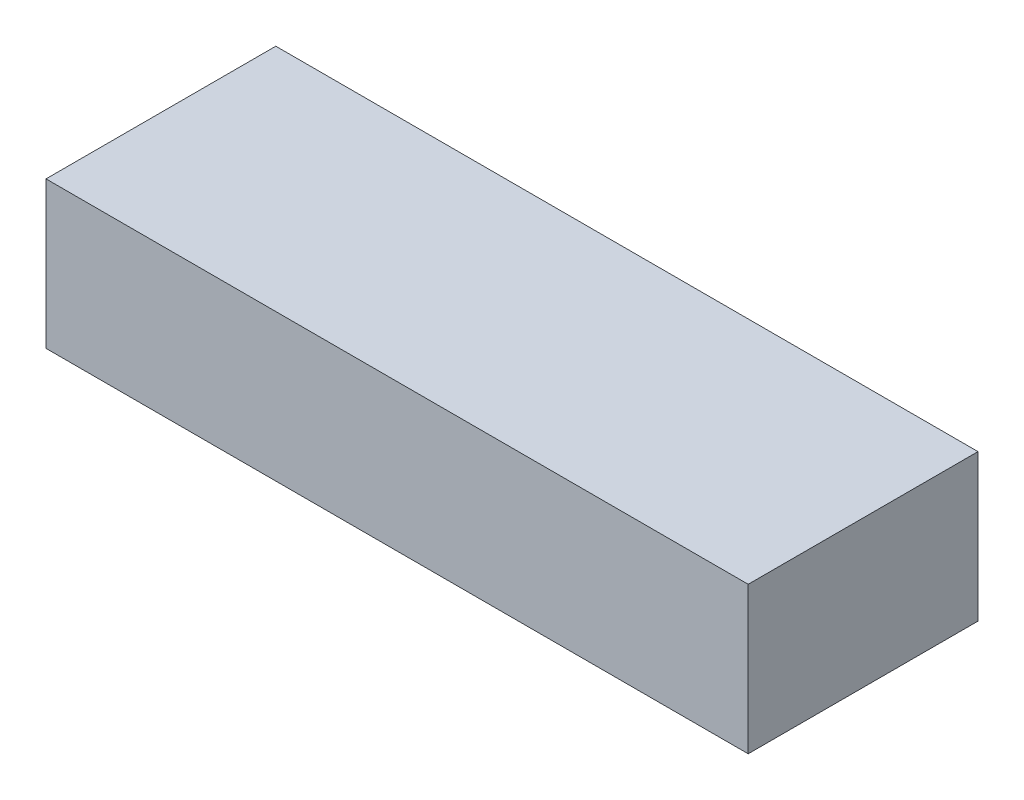
ISO-10303-21;
HEADER;
FILE_DESCRIPTION(('STEP AP214'),'2;1');
FILE_NAME('part.step','',(''),(''),'','','');
FILE_SCHEMA(('AUTOMOTIVE_DESIGN { 1 0 10303 214 1 1 1 1 }'));
ENDSEC;
DATA;
#1=APPLICATION_CONTEXT('core data for automotive mechanical design processes');
#2=APPLICATION_PROTOCOL_DEFINITION('international standard','automotive_design',2000,#1);
#3=PRODUCT_CONTEXT('',#1,'mechanical');
#4=PRODUCT('Part','Part','',(#3));
#5=PRODUCT_RELATED_PRODUCT_CATEGORY('part','',(#4));
#6=PRODUCT_DEFINITION_FORMATION('','',#4);
#7=PRODUCT_DEFINITION_CONTEXT('part definition',#1,'design');
#8=PRODUCT_DEFINITION('design','',#6,#7);
#9=PRODUCT_DEFINITION_SHAPE('','',#8);
#10=(LENGTH_UNIT() NAMED_UNIT(*) SI_UNIT(.MILLI.,.METRE.));
#11=(NAMED_UNIT(*) PLANE_ANGLE_UNIT() SI_UNIT($,.RADIAN.));
#12=(NAMED_UNIT(*) SI_UNIT($,.STERADIAN.) SOLID_ANGLE_UNIT());
#13=UNCERTAINTY_MEASURE_WITH_UNIT(LENGTH_MEASURE(1.E-05),#10,'distance_accuracy_value','');
#14=(GEOMETRIC_REPRESENTATION_CONTEXT(3) GLOBAL_UNCERTAINTY_ASSIGNED_CONTEXT((#13)) GLOBAL_UNIT_ASSIGNED_CONTEXT((#10,
#11,#12)) REPRESENTATION_CONTEXT('',''));
#15=CARTESIAN_POINT('',(0.,0.,0.));
#16=DIRECTION('',(0.,0.,1.));
#17=DIRECTION('',(1.,0.,0.));
#18=AXIS2_PLACEMENT_3D('',#15,#16,#17);
#19=CARTESIAN_POINT('',(55.,23.,-18.));
#20=DIRECTION('',(-1.,0.,0.));
#21=DIRECTION('',(0.,0.,1.));
#22=AXIS2_PLACEMENT_3D('',#19,#20,#21);
#23=PLANE('',#22);
#24=DIRECTION('',(0.,0.,-1.));
#25=VECTOR('',#24,1.);
#26=CARTESIAN_POINT('',(55.,0.,-18.));
#27=LINE('',#26,#25);
#28=CARTESIAN_POINT('',(55.,0.,18.));
#29=VERTEX_POINT('',#28);
#30=CARTESIAN_POINT('',(55.,0.,-18.));
#31=VERTEX_POINT('',#30);
#32=EDGE_CURVE('E107',#29,#31,#27,.T.);
#33=ORIENTED_EDGE('',*,*,#32,.T.);
#34=DIRECTION('',(0.,-1.,0.));
#35=VECTOR('',#34,1.);
#36=CARTESIAN_POINT('',(55.,23.,-18.));
#37=LINE('',#36,#35);
#38=CARTESIAN_POINT('',(55.,23.,-18.));
#39=VERTEX_POINT('',#38);
#40=EDGE_CURVE('E11',#39,#31,#37,.T.);
#41=ORIENTED_EDGE('',*,*,#40,.F.);
#42=DIRECTION('',(0.,0.,-1.));
#43=VECTOR('',#42,1.);
#44=CARTESIAN_POINT('',(55.,23.,-18.));
#45=LINE('',#44,#43);
#46=CARTESIAN_POINT('',(55.,23.,18.));
#47=VERTEX_POINT('',#46);
#48=EDGE_CURVE('E91',#47,#39,#45,.T.);
#49=ORIENTED_EDGE('',*,*,#48,.F.);
#50=DIRECTION('',(0.,-1.,0.));
#51=VECTOR('',#50,1.);
#52=CARTESIAN_POINT('',(55.,23.,18.));
#53=LINE('',#52,#51);
#54=EDGE_CURVE('E103',#47,#29,#53,.T.);
#55=ORIENTED_EDGE('',*,*,#54,.T.);
#56=EDGE_LOOP('',(#33,#41,#49,#55));
#57=FACE_BOUND('',#56,.T.);
#58=ADVANCED_FACE('F39',(#57),#23,.F.);
#59=CARTESIAN_POINT('',(-55.,23.,-18.));
#60=DIRECTION('',(0.,0.,1.));
#61=DIRECTION('',(1.,0.,0.));
#62=AXIS2_PLACEMENT_3D('',#59,#60,#61);
#63=PLANE('',#62);
#64=DIRECTION('',(-1.,0.,0.));
#65=VECTOR('',#64,1.);
#66=CARTESIAN_POINT('',(-55.,0.,-18.));
#67=LINE('',#66,#65);
#68=CARTESIAN_POINT('',(-55.,0.,-18.));
#69=VERTEX_POINT('',#68);
#70=EDGE_CURVE('E96',#31,#69,#67,.T.);
#71=ORIENTED_EDGE('',*,*,#70,.T.);
#72=DIRECTION('',(0.,-1.,0.));
#73=VECTOR('',#72,1.);
#74=CARTESIAN_POINT('',(-55.,23.,-18.));
#75=LINE('',#74,#73);
#76=CARTESIAN_POINT('',(-55.,23.,-18.));
#77=VERTEX_POINT('',#76);
#78=EDGE_CURVE('E48',#77,#69,#75,.T.);
#79=ORIENTED_EDGE('',*,*,#78,.F.);
#80=DIRECTION('',(-1.,0.,0.));
#81=VECTOR('',#80,1.);
#82=CARTESIAN_POINT('',(-55.,23.,-18.));
#83=LINE('',#82,#81);
#84=EDGE_CURVE('E86',#39,#77,#83,.T.);
#85=ORIENTED_EDGE('',*,*,#84,.F.);
#86=ORIENTED_EDGE('',*,*,#40,.T.);
#87=EDGE_LOOP('',(#71,#79,#85,#86));
#88=FACE_BOUND('',#87,.T.);
#89=ADVANCED_FACE('F95',(#88),#63,.F.);
#90=CARTESIAN_POINT('',(-55.,23.,-18.));
#91=DIRECTION('',(1.,0.,0.));
#92=DIRECTION('',(0.,0.,-1.));
#93=AXIS2_PLACEMENT_3D('',#90,#91,#92);
#94=PLANE('',#93);
#95=DIRECTION('',(0.,0.,1.));
#96=VECTOR('',#95,1.);
#97=CARTESIAN_POINT('',(-55.,0.,-18.));
#98=LINE('',#97,#96);
#99=CARTESIAN_POINT('',(-55.,0.,18.));
#100=VERTEX_POINT('',#99);
#101=EDGE_CURVE('E73',#69,#100,#98,.T.);
#102=ORIENTED_EDGE('',*,*,#101,.T.);
#103=DIRECTION('',(0.,-1.,0.));
#104=VECTOR('',#103,1.);
#105=CARTESIAN_POINT('',(-55.,23.,18.));
#106=LINE('',#105,#104);
#107=CARTESIAN_POINT('',(-55.,23.,18.));
#108=VERTEX_POINT('',#107);
#109=EDGE_CURVE('E98',#108,#100,#106,.T.);
#110=ORIENTED_EDGE('',*,*,#109,.F.);
#111=DIRECTION('',(0.,0.,1.));
#112=VECTOR('',#111,1.);
#113=CARTESIAN_POINT('',(-55.,23.,-18.));
#114=LINE('',#113,#112);
#115=EDGE_CURVE('E89',#77,#108,#114,.T.);
#116=ORIENTED_EDGE('',*,*,#115,.F.);
#117=ORIENTED_EDGE('',*,*,#78,.T.);
#118=EDGE_LOOP('',(#102,#110,#116,#117));
#119=FACE_BOUND('',#118,.T.);
#120=ADVANCED_FACE('F99',(#119),#94,.F.);
#121=CARTESIAN_POINT('',(-55.,23.,18.));
#122=DIRECTION('',(0.,0.,-1.));
#123=DIRECTION('',(-1.,0.,0.));
#124=AXIS2_PLACEMENT_3D('',#121,#122,#123);
#125=PLANE('',#124);
#126=DIRECTION('',(1.,0.,0.));
#127=VECTOR('',#126,1.);
#128=CARTESIAN_POINT('',(-55.,0.,18.));
#129=LINE('',#128,#127);
#130=EDGE_CURVE('E79',#100,#29,#129,.T.);
#131=ORIENTED_EDGE('',*,*,#130,.T.);
#132=ORIENTED_EDGE('',*,*,#54,.F.);
#133=DIRECTION('',(1.,0.,0.));
#134=VECTOR('',#133,1.);
#135=CARTESIAN_POINT('',(-55.,23.,18.));
#136=LINE('',#135,#134);
#137=EDGE_CURVE('E56',#108,#47,#136,.T.);
#138=ORIENTED_EDGE('',*,*,#137,.F.);
#139=ORIENTED_EDGE('',*,*,#109,.T.);
#140=EDGE_LOOP('',(#131,#132,#138,#139));
#141=FACE_BOUND('',#140,.T.);
#142=ADVANCED_FACE('F120',(#141),#125,.F.);
#143=CARTESIAN_POINT('',(0.,23.,0.));
#144=DIRECTION('',(0.,1.,0.));
#145=DIRECTION('',(0.,0.,1.));
#146=AXIS2_PLACEMENT_3D('',#143,#144,#145);
#147=PLANE('',#146);
#148=ORIENTED_EDGE('',*,*,#48,.T.);
#149=ORIENTED_EDGE('',*,*,#84,.T.);
#150=ORIENTED_EDGE('',*,*,#115,.T.);
#151=ORIENTED_EDGE('',*,*,#137,.T.);
#152=EDGE_LOOP('',(#148,#149,#150,#151));
#153=FACE_BOUND('',#152,.T.);
#154=ADVANCED_FACE('F87',(#153),#147,.T.);
#155=CARTESIAN_POINT('',(0.,0.,0.));
#156=DIRECTION('',(0.,1.,0.));
#157=DIRECTION('',(0.,0.,1.));
#158=AXIS2_PLACEMENT_3D('',#155,#156,#157);
#159=PLANE('',#158);
#160=ORIENTED_EDGE('',*,*,#32,.F.);
#161=ORIENTED_EDGE('',*,*,#130,.F.);
#162=ORIENTED_EDGE('',*,*,#101,.F.);
#163=ORIENTED_EDGE('',*,*,#70,.F.);
#164=EDGE_LOOP('',(#160,#161,#162,#163));
#165=FACE_BOUND('',#164,.T.);
#166=ADVANCED_FACE('F123',(#165),#159,.F.);
#167=CLOSED_SHELL('',(#58,#89,#120,#142,#154,#166));
#168=MANIFOLD_SOLID_BREP('B2',#167);
#169=ADVANCED_BREP_SHAPE_REPRESENTATION('',(#18,#168),#14);
#170=SHAPE_DEFINITION_REPRESENTATION(#9,#169);
ENDSEC;
END-ISO-10303-21;
